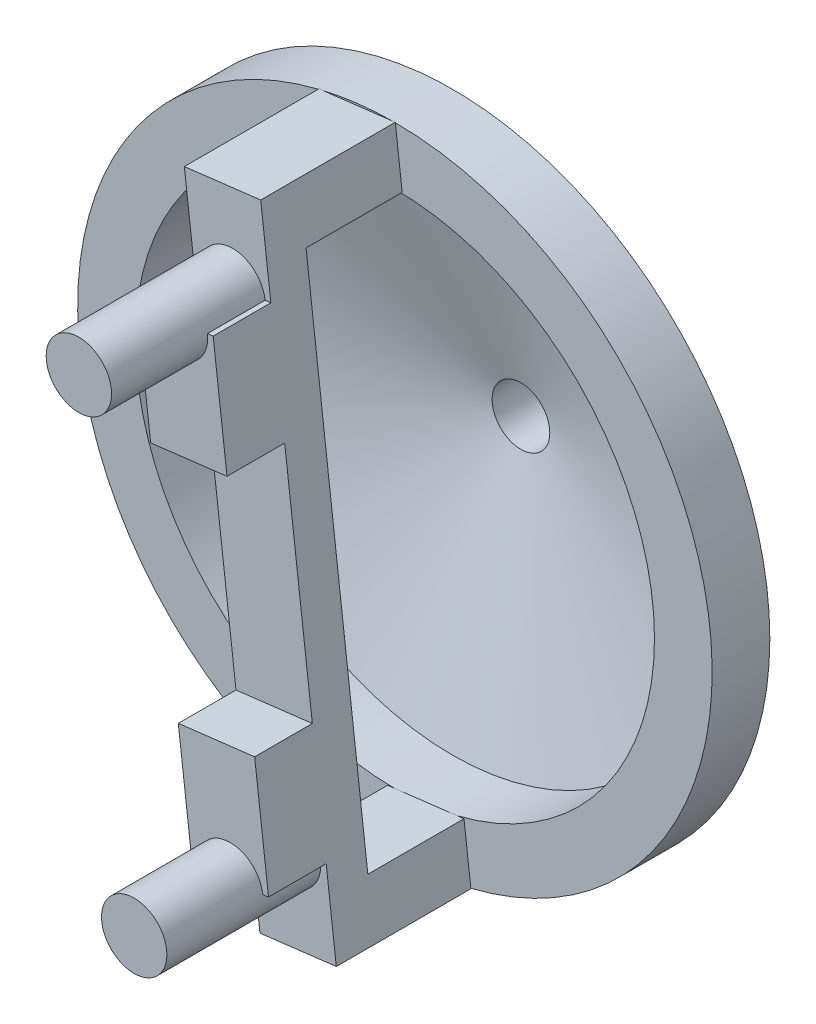
ISO-10303-21;
HEADER;
FILE_DESCRIPTION(('STEP AP214'),'2;1');
FILE_NAME('part.step','',(''),(''),'','','');
FILE_SCHEMA(('AUTOMOTIVE_DESIGN { 1 0 10303 214 1 1 1 1 }'));
ENDSEC;
DATA;
#1=APPLICATION_CONTEXT('core data for automotive mechanical design processes');
#2=APPLICATION_PROTOCOL_DEFINITION('international standard','automotive_design',2000,#1);
#3=PRODUCT_CONTEXT('',#1,'mechanical');
#4=PRODUCT('Part','Part','',(#3));
#5=PRODUCT_RELATED_PRODUCT_CATEGORY('part','',(#4));
#6=PRODUCT_DEFINITION_FORMATION('','',#4);
#7=PRODUCT_DEFINITION_CONTEXT('part definition',#1,'design');
#8=PRODUCT_DEFINITION('design','',#6,#7);
#9=PRODUCT_DEFINITION_SHAPE('','',#8);
#10=(LENGTH_UNIT() NAMED_UNIT(*) SI_UNIT(.MILLI.,.METRE.));
#11=(NAMED_UNIT(*) PLANE_ANGLE_UNIT() SI_UNIT($,.RADIAN.));
#12=(NAMED_UNIT(*) SI_UNIT($,.STERADIAN.) SOLID_ANGLE_UNIT());
#13=UNCERTAINTY_MEASURE_WITH_UNIT(LENGTH_MEASURE(1.E-05),#10,'distance_accuracy_value','');
#14=(GEOMETRIC_REPRESENTATION_CONTEXT(3) GLOBAL_UNCERTAINTY_ASSIGNED_CONTEXT((#13)) GLOBAL_UNIT_ASSIGNED_CONTEXT((#10,
#11,#12)) REPRESENTATION_CONTEXT('',''));
#15=CARTESIAN_POINT('',(0.,0.,0.));
#16=DIRECTION('',(0.,0.,1.));
#17=DIRECTION('',(1.,0.,0.));
#18=AXIS2_PLACEMENT_3D('',#15,#16,#17);
#19=CARTESIAN_POINT('',(0.0107708516474273,8.24999296901245,18.));
#20=DIRECTION('',(0.,0.,-1.));
#21=DIRECTION('',(-1.,0.,0.));
#22=AXIS2_PLACEMENT_3D('',#19,#20,#21);
#23=PLANE('',#22);
#24=DIRECTION('',(-0.992784030995101,-0.119916086498513,0.));
#25=VECTOR('',#24,1.);
#26=CARTESIAN_POINT('',(1.35253229049064,-2.85843600648679,18.));
#27=LINE('',#26,#25);
#28=CARTESIAN_POINT('',(1.35253229049064,-2.85843600648679,18.));
#29=VERTEX_POINT('',#28);
#30=CARTESIAN_POINT('',(-0.633035771499563,-3.09826817948382,18.));
#31=VERTEX_POINT('',#30);
#32=EDGE_CURVE('E218',#29,#31,#27,.T.);
#33=ORIENTED_EDGE('',*,*,#32,.F.);
#34=DIRECTION('',(-0.119916086498513,0.992784030995101,0.));
#35=VECTOR('',#34,1.);
#36=CARTESIAN_POINT('',(0.0107708516474273,8.24999296901245,18.));
#37=LINE('',#36,#35);
#38=CARTESIAN_POINT('',(0.633035771499563,3.09826817948381,18.));
#39=VERTEX_POINT('',#38);
#40=EDGE_CURVE('E204',#29,#39,#37,.T.);
#41=ORIENTED_EDGE('',*,*,#40,.T.);
#42=DIRECTION('',(0.992784030995101,0.119916086498513,0.));
#43=VECTOR('',#42,1.);
#44=CARTESIAN_POINT('',(-1.35253229049064,2.85843600648679,18.));
#45=LINE('',#44,#43);
#46=CARTESIAN_POINT('',(-1.35253229049064,2.85843600648679,18.));
#47=VERTEX_POINT('',#46);
#48=EDGE_CURVE('E472',#47,#39,#45,.T.);
#49=ORIENTED_EDGE('',*,*,#48,.F.);
#50=DIRECTION('',(0.119916086498513,-0.992784030995101,0.));
#51=VECTOR('',#50,1.);
#52=CARTESIAN_POINT('',(-1.97479721034277,8.01016079601542,18.));
#53=LINE('',#52,#51);
#54=EDGE_CURVE('E448',#47,#31,#53,.T.);
#55=ORIENTED_EDGE('',*,*,#54,.T.);
#56=EDGE_LOOP('',(#33,#41,#49,#55));
#57=FACE_BOUND('',#56,.T.);
#58=ADVANCED_FACE('F200',(#57),#23,.F.);
#59=DIRECTION('',(0.992784030995101,0.119916086498513,0.));
#60=VECTOR('',#59,1.);
#61=CARTESIAN_POINT('',(1.71228054998618,-5.83678809947209,18.));
#62=LINE('',#61,#60);
#63=CARTESIAN_POINT('',(-0.273287512004025,-6.07662027246912,18.));
#64=VERTEX_POINT('',#63);
#65=CARTESIAN_POINT('',(1.71228054998618,-5.83678809947209,18.));
#66=VERTEX_POINT('',#65);
#67=EDGE_CURVE('E226',#64,#66,#62,.T.);
#68=ORIENTED_EDGE('',*,*,#67,.F.);
#69=CARTESIAN_POINT('',(-0.00947212170729466,-8.26074514065834,18.));
#70=VERTEX_POINT('',#69);
#71=EDGE_CURVE('E458',#64,#70,#53,.T.);
#72=ORIENTED_EDGE('',*,*,#71,.T.);
#73=DIRECTION('',(0.992784030995101,0.119916086498514,0.));
#74=VECTOR('',#73,1.);
#75=CARTESIAN_POINT('',(-0.00947212170729466,-8.26074514065834,18.));
#76=LINE('',#75,#74);
#77=CARTESIAN_POINT('',(1.97609594028291,-8.02091296766131,18.));
#78=VERTEX_POINT('',#77);
#79=EDGE_CURVE('E564',#70,#78,#76,.T.);
#80=ORIENTED_EDGE('',*,*,#79,.T.);
#81=EDGE_CURVE('E518',#78,#66,#37,.T.);
#82=ORIENTED_EDGE('',*,*,#81,.T.);
#83=EDGE_LOOP('',(#68,#72,#80,#82));
#84=FACE_BOUND('',#83,.T.);
#85=ADVANCED_FACE('F547',(#84),#23,.F.);
#86=CARTESIAN_POINT('',(-0.719496518991075,5.95670418597061,22.));
#87=DIRECTION('',(0.,0.,-1.));
#88=DIRECTION('',(-1.,0.,0.));
#89=AXIS2_PLACEMENT_3D('',#86,#87,#88);
#90=CYLINDRICAL_SURFACE('',#89,0.85);
#91=CARTESIAN_POINT('',(-0.719496518991075,5.95670418597061,22.));
#92=DIRECTION('',(0.,0.,1.));
#93=DIRECTION('',(1.,0.,0.));
#94=AXIS2_PLACEMENT_3D('',#91,#92,#93);
#95=CIRCLE('',#94,0.85);
#96=CARTESIAN_POINT('',(0.130503481008925,5.95670418597061,22.));
#97=VERTEX_POINT('',#96);
#98=EDGE_CURVE('E210',#97,#97,#95,.T.);
#99=ORIENTED_EDGE('',*,*,#98,.F.);
#100=EDGE_LOOP('',(#99));
#101=FACE_BOUND('',#100,.T.);
#102=DIRECTION('',(0.,0.,-1.));
#103=VECTOR('',#102,1.);
#104=CARTESIAN_POINT('',(-1.56336294533691,5.85477551244687,22.));
#105=LINE('',#104,#103);
#106=CARTESIAN_POINT('',(-1.56336294533691,5.85477551244687,19.5));
#107=VERTEX_POINT('',#106);
#108=CARTESIAN_POINT('',(-1.56336294533691,5.85477551244687,18.));
#109=VERTEX_POINT('',#108);
#110=EDGE_CURVE('E534',#107,#109,#105,.T.);
#111=ORIENTED_EDGE('',*,*,#110,.F.);
#112=CARTESIAN_POINT('',(-0.719496518991075,5.95670418597061,19.5));
#113=DIRECTION('',(0.,0.,1.));
#114=DIRECTION('',(1.,0.,0.));
#115=AXIS2_PLACEMENT_3D('',#112,#113,#114);
#116=CIRCLE('',#115,0.85);
#117=CARTESIAN_POINT('',(0.12436990735476,6.05863285949434,19.5));
#118=VERTEX_POINT('',#117);
#119=EDGE_CURVE('E14',#107,#118,#116,.T.);
#120=ORIENTED_EDGE('',*,*,#119,.T.);
#121=DIRECTION('',(0.,0.,-1.));
#122=VECTOR('',#121,1.);
#123=CARTESIAN_POINT('',(0.12436990735476,6.05863285949434,22.));
#124=LINE('',#123,#122);
#125=CARTESIAN_POINT('',(0.12436990735476,6.05863285949434,18.));
#126=VERTEX_POINT('',#125);
#127=EDGE_CURVE('E466',#126,#118,#124,.F.);
#128=ORIENTED_EDGE('',*,*,#127,.F.);
#129=CARTESIAN_POINT('',(-0.719496518991075,5.95670418597061,18.));
#130=DIRECTION('',(0.,0.,1.));
#131=DIRECTION('',(1.,0.,0.));
#132=AXIS2_PLACEMENT_3D('',#129,#130,#131);
#133=CIRCLE('',#132,0.85);
#134=EDGE_CURVE('E536',#126,#109,#133,.T.);
#135=ORIENTED_EDGE('',*,*,#134,.T.);
#136=EDGE_LOOP('',(#111,#120,#128,#135));
#137=FACE_BOUND('',#136,.T.);
#138=ADVANCED_FACE('F202',(#101,#137),#90,.T.);
#139=CARTESIAN_POINT('',(-0.719496518991075,5.95670418597061,22.));
#140=DIRECTION('',(0.,0.,1.));
#141=DIRECTION('',(1.,0.,0.));
#142=AXIS2_PLACEMENT_3D('',#139,#140,#141);
#143=PLANE('',#142);
#144=ORIENTED_EDGE('',*,*,#98,.T.);
#145=EDGE_LOOP('',(#144));
#146=FACE_BOUND('',#145,.T.);
#147=ADVANCED_FACE('F544',(#146),#143,.T.);
#148=CARTESIAN_POINT('',(-1.35253229049064,2.85843600648679,19.5));
#149=DIRECTION('',(0.,0.,1.));
#150=DIRECTION('',(1.,0.,0.));
#151=AXIS2_PLACEMENT_3D('',#148,#149,#150);
#152=PLANE('',#151);
#153=ORIENTED_EDGE('',*,*,#119,.F.);
#154=DIRECTION('',(-0.992784030995101,-0.119916086498513,0.));
#155=VECTOR('',#154,1.);
#156=CARTESIAN_POINT('',(-1.71228054998618,5.83678809947209,19.5));
#157=LINE('',#156,#155);
#158=CARTESIAN_POINT('',(-1.71228054998618,5.83678809947209,19.5));
#159=VERTEX_POINT('',#158);
#160=EDGE_CURVE('E507',#107,#159,#157,.T.);
#161=ORIENTED_EDGE('',*,*,#160,.T.);
#162=DIRECTION('',(0.119916086498513,-0.992784030995101,0.));
#163=VECTOR('',#162,1.);
#164=CARTESIAN_POINT('',(-1.71228054998618,5.83678809947209,19.5));
#165=LINE('',#164,#163);
#166=CARTESIAN_POINT('',(-1.35253229049064,2.85843600648679,19.5));
#167=VERTEX_POINT('',#166);
#168=EDGE_CURVE('E495',#159,#167,#165,.T.);
#169=ORIENTED_EDGE('',*,*,#168,.T.);
#170=DIRECTION('',(0.992784030995101,0.119916086498513,0.));
#171=VECTOR('',#170,1.);
#172=CARTESIAN_POINT('',(-1.35253229049064,2.85843600648679,19.5));
#173=LINE('',#172,#171);
#174=CARTESIAN_POINT('',(0.633035771499564,3.09826817948382,19.5));
#175=VERTEX_POINT('',#174);
#176=EDGE_CURVE('E513',#167,#175,#173,.T.);
#177=ORIENTED_EDGE('',*,*,#176,.T.);
#178=DIRECTION('',(-0.119916086498513,0.992784030995101,0.));
#179=VECTOR('',#178,1.);
#180=CARTESIAN_POINT('',(0.273287512004025,6.07662027246912,19.5));
#181=LINE('',#180,#179);
#182=CARTESIAN_POINT('',(0.273287512004025,6.07662027246912,19.5));
#183=VERTEX_POINT('',#182);
#184=EDGE_CURVE('E510',#175,#183,#181,.T.);
#185=ORIENTED_EDGE('',*,*,#184,.T.);
#186=EDGE_CURVE('E483',#183,#118,#157,.T.);
#187=ORIENTED_EDGE('',*,*,#186,.T.);
#188=EDGE_LOOP('',(#153,#161,#169,#177,#185,#187));
#189=FACE_BOUND('',#188,.T.);
#190=ADVANCED_FACE('F548',(#189),#152,.T.);
#191=CARTESIAN_POINT('',(-1.71228054998618,5.83678809947209,19.5));
#192=DIRECTION('',(0.119916086498513,-0.992784030995101,0.));
#193=DIRECTION('',(0.992784030995101,0.119916086498513,0.));
#194=AXIS2_PLACEMENT_3D('',#191,#192,#193);
#195=PLANE('',#194);
#196=ORIENTED_EDGE('',*,*,#160,.F.);
#197=ORIENTED_EDGE('',*,*,#110,.T.);
#198=DIRECTION('',(-0.992784030995101,-0.119916086498513,0.));
#199=VECTOR('',#198,1.);
#200=CARTESIAN_POINT('',(-1.71228054998618,5.83678809947209,18.));
#201=LINE('',#200,#199);
#202=CARTESIAN_POINT('',(-1.71228054998618,5.83678809947209,18.));
#203=VERTEX_POINT('',#202);
#204=EDGE_CURVE('E476',#109,#203,#201,.T.);
#205=ORIENTED_EDGE('',*,*,#204,.T.);
#206=DIRECTION('',(0.,0.,-1.));
#207=VECTOR('',#206,1.);
#208=CARTESIAN_POINT('',(-1.71228054998618,5.83678809947209,19.5));
#209=LINE('',#208,#207);
#210=EDGE_CURVE('E498',#159,#203,#209,.T.);
#211=ORIENTED_EDGE('',*,*,#210,.F.);
#212=EDGE_LOOP('',(#196,#197,#205,#211));
#213=FACE_BOUND('',#212,.T.);
#214=ADVANCED_FACE('F549',(#213),#195,.F.);
#215=CARTESIAN_POINT('',(0.273287512004025,6.07662027246912,18.));
#216=VERTEX_POINT('',#215);
#217=EDGE_CURVE('E492',#216,#126,#201,.T.);
#218=ORIENTED_EDGE('',*,*,#217,.T.);
#219=ORIENTED_EDGE('',*,*,#127,.T.);
#220=ORIENTED_EDGE('',*,*,#186,.F.);
#221=DIRECTION('',(0.,0.,-1.));
#222=VECTOR('',#221,1.);
#223=CARTESIAN_POINT('',(0.273287512004025,6.07662027246912,19.5));
#224=LINE('',#223,#222);
#225=EDGE_CURVE('E471',#183,#216,#224,.T.);
#226=ORIENTED_EDGE('',*,*,#225,.T.);
#227=EDGE_LOOP('',(#218,#219,#220,#226));
#228=FACE_BOUND('',#227,.T.);
#229=ADVANCED_FACE('F530',(#228),#195,.F.);
#230=CARTESIAN_POINT('',(-1.71228054998618,5.83678809947209,19.5));
#231=DIRECTION('',(0.992784030995101,0.119916086498513,0.));
#232=DIRECTION('',(-0.119916086498513,0.992784030995101,0.));
#233=AXIS2_PLACEMENT_3D('',#230,#231,#232);
#234=PLANE('',#233);
#235=ORIENTED_EDGE('',*,*,#210,.T.);
#236=CARTESIAN_POINT('',(-1.97609594028291,8.02091296766131,18.));
#237=VERTEX_POINT('',#236);
#238=EDGE_CURVE('E444',#237,#203,#53,.T.);
#239=ORIENTED_EDGE('',*,*,#238,.F.);
#240=DIRECTION('',(0.,0.,-1.));
#241=VECTOR('',#240,1.);
#242=CARTESIAN_POINT('',(-1.97609594028291,8.02091296766131,18.));
#243=LINE('',#242,#241);
#244=CARTESIAN_POINT('',(-1.97609594028291,8.02091296766131,14.5));
#245=VERTEX_POINT('',#244);
#246=EDGE_CURVE('E676',#237,#245,#243,.T.);
#247=ORIENTED_EDGE('',*,*,#246,.T.);
#248=DIRECTION('',(0.119916086498514,-0.992784030995101,0.));
#249=VECTOR('',#248,1.);
#250=CARTESIAN_POINT('',(-1.79622181053513,6.53173692116866,14.5));
#251=LINE('',#250,#249);
#252=CARTESIAN_POINT('',(-1.97479721034278,8.01016079601542,14.5));
#253=VERTEX_POINT('',#252);
#254=EDGE_CURVE('E650',#245,#253,#251,.T.);
#255=ORIENTED_EDGE('',*,*,#254,.T.);
#256=CARTESIAN_POINT('',(-1.79622181053513,6.53173692116866,14.5));
#257=VERTEX_POINT('',#256);
#258=EDGE_CURVE('E652',#253,#257,#251,.T.);
#259=ORIENTED_EDGE('',*,*,#258,.T.);
#260=DIRECTION('',(0.,0.,-1.));
#261=VECTOR('',#260,1.);
#262=CARTESIAN_POINT('',(-1.79622181053513,6.53173692116866,18.));
#263=LINE('',#262,#261);
#264=CARTESIAN_POINT('',(-1.79622181053513,6.53173692116866,17.));
#265=VERTEX_POINT('',#264);
#266=EDGE_CURVE('E660',#265,#257,#263,.T.);
#267=ORIENTED_EDGE('',*,*,#266,.F.);
#268=DIRECTION('',(0.119916086498513,-0.992784030995101,0.));
#269=VECTOR('',#268,1.);
#270=CARTESIAN_POINT('',(-1.97479721034277,8.01016079601542,17.));
#271=LINE('',#270,#269);
#272=CARTESIAN_POINT('',(-0.189346251455067,-6.77156909416569,17.));
#273=VERTEX_POINT('',#272);
#274=EDGE_CURVE('E598',#265,#273,#271,.T.);
#275=ORIENTED_EDGE('',*,*,#274,.T.);
#276=DIRECTION('',(0.,0.,-1.));
#277=VECTOR('',#276,1.);
#278=CARTESIAN_POINT('',(-0.189346251455066,-6.77156909416569,18.));
#279=LINE('',#278,#277);
#280=CARTESIAN_POINT('',(-0.189346251455066,-6.77156909416569,14.5));
#281=VERTEX_POINT('',#280);
#282=EDGE_CURVE('E571',#273,#281,#279,.T.);
#283=ORIENTED_EDGE('',*,*,#282,.T.);
#284=DIRECTION('',(0.119916086498514,-0.992784030995101,0.));
#285=VECTOR('',#284,1.);
#286=CARTESIAN_POINT('',(-0.189346251455066,-6.77156909416569,14.5));
#287=LINE('',#286,#285);
#288=CARTESIAN_POINT('',(-0.0107708516474245,-8.24999296901245,14.5));
#289=VERTEX_POINT('',#288);
#290=EDGE_CURVE('E584',#281,#289,#287,.T.);
#291=ORIENTED_EDGE('',*,*,#290,.T.);
#292=CARTESIAN_POINT('',(-0.00947212170729466,-8.26074514065834,14.5));
#293=VERTEX_POINT('',#292);
#294=EDGE_CURVE('E588',#289,#293,#287,.T.);
#295=ORIENTED_EDGE('',*,*,#294,.T.);
#296=DIRECTION('',(0.,0.,-1.));
#297=VECTOR('',#296,1.);
#298=CARTESIAN_POINT('',(-0.00947212170729466,-8.26074514065834,18.));
#299=LINE('',#298,#297);
#300=EDGE_CURVE('E452',#70,#293,#299,.T.);
#301=ORIENTED_EDGE('',*,*,#300,.F.);
#302=ORIENTED_EDGE('',*,*,#71,.F.);
#303=DIRECTION('',(0.,0.,-1.));
#304=VECTOR('',#303,1.);
#305=CARTESIAN_POINT('',(-0.273287512004025,-6.07662027246912,19.5));
#306=LINE('',#305,#304);
#307=CARTESIAN_POINT('',(-0.273287512004025,-6.07662027246912,19.5));
#308=VERTEX_POINT('',#307);
#309=EDGE_CURVE('E390',#308,#64,#306,.T.);
#310=ORIENTED_EDGE('',*,*,#309,.F.);
#311=DIRECTION('',(0.119916086498513,-0.992784030995101,0.));
#312=VECTOR('',#311,1.);
#313=CARTESIAN_POINT('',(-0.273287512004025,-6.07662027246912,19.5));
#314=LINE('',#313,#312);
#315=CARTESIAN_POINT('',(-0.633035771499564,-3.09826817948382,19.5));
#316=VERTEX_POINT('',#315);
#317=EDGE_CURVE('E372',#316,#308,#314,.T.);
#318=ORIENTED_EDGE('',*,*,#317,.F.);
#319=DIRECTION('',(0.,0.,-1.));
#320=VECTOR('',#319,1.);
#321=CARTESIAN_POINT('',(-0.633035771499564,-3.09826817948382,19.5));
#322=LINE('',#321,#320);
#323=EDGE_CURVE('E369',#316,#31,#322,.T.);
#324=ORIENTED_EDGE('',*,*,#323,.T.);
#325=ORIENTED_EDGE('',*,*,#54,.F.);
#326=DIRECTION('',(0.,0.,-1.));
#327=VECTOR('',#326,1.);
#328=CARTESIAN_POINT('',(-1.35253229049064,2.85843600648679,19.5));
#329=LINE('',#328,#327);
#330=EDGE_CURVE('E463',#167,#47,#329,.T.);
#331=ORIENTED_EDGE('',*,*,#330,.F.);
#332=ORIENTED_EDGE('',*,*,#168,.F.);
#333=EDGE_LOOP('',(#235,#239,#247,#255,#259,#267,#275,#283,#291,#295,#301,#302,#310,#318,#324,
#325,#331,#332));
#334=FACE_BOUND('',#333,.T.);
#335=ADVANCED_FACE('F550',(#334),#234,.F.);
#336=CARTESIAN_POINT('',(-1.35253229049064,2.85843600648679,19.5));
#337=DIRECTION('',(-0.119916086498513,0.992784030995101,0.));
#338=DIRECTION('',(-0.992784030995101,-0.119916086498513,0.));
#339=AXIS2_PLACEMENT_3D('',#336,#337,#338);
#340=PLANE('',#339);
#341=ORIENTED_EDGE('',*,*,#48,.T.);
#342=DIRECTION('',(0.,0.,-1.));
#343=VECTOR('',#342,1.);
#344=CARTESIAN_POINT('',(0.633035771499564,3.09826817948382,19.5));
#345=LINE('',#344,#343);
#346=EDGE_CURVE('E467',#175,#39,#345,.T.);
#347=ORIENTED_EDGE('',*,*,#346,.F.);
#348=ORIENTED_EDGE('',*,*,#176,.F.);
#349=ORIENTED_EDGE('',*,*,#330,.T.);
#350=EDGE_LOOP('',(#341,#347,#348,#349));
#351=FACE_BOUND('',#350,.T.);
#352=ADVANCED_FACE('F525',(#351),#340,.F.);
#353=CARTESIAN_POINT('',(0.273287512004025,6.07662027246912,19.5));
#354=DIRECTION('',(-0.992784030995101,-0.119916086498513,0.));
#355=DIRECTION('',(0.119916086498513,-0.992784030995101,0.));
#356=AXIS2_PLACEMENT_3D('',#353,#354,#355);
#357=PLANE('',#356);
#358=ORIENTED_EDGE('',*,*,#346,.T.);
#359=ORIENTED_EDGE('',*,*,#40,.F.);
#360=DIRECTION('',(0.,0.,-1.));
#361=VECTOR('',#360,1.);
#362=CARTESIAN_POINT('',(1.35253229049064,-2.85843600648679,19.5));
#363=LINE('',#362,#361);
#364=CARTESIAN_POINT('',(1.35253229049064,-2.85843600648679,19.5));
#365=VERTEX_POINT('',#364);
#366=EDGE_CURVE('E367',#365,#29,#363,.T.);
#367=ORIENTED_EDGE('',*,*,#366,.F.);
#368=DIRECTION('',(-0.119916086498513,0.992784030995101,0.));
#369=VECTOR('',#368,1.);
#370=CARTESIAN_POINT('',(1.71228054998618,-5.83678809947209,19.5));
#371=LINE('',#370,#369);
#372=CARTESIAN_POINT('',(1.71228054998618,-5.83678809947209,19.5));
#373=VERTEX_POINT('',#372);
#374=EDGE_CURVE('E373',#373,#365,#371,.T.);
#375=ORIENTED_EDGE('',*,*,#374,.F.);
#376=DIRECTION('',(0.,0.,-1.));
#377=VECTOR('',#376,1.);
#378=CARTESIAN_POINT('',(1.71228054998618,-5.83678809947209,19.5));
#379=LINE('',#378,#377);
#380=EDGE_CURVE('E556',#373,#66,#379,.T.);
#381=ORIENTED_EDGE('',*,*,#380,.T.);
#382=ORIENTED_EDGE('',*,*,#81,.F.);
#383=DIRECTION('',(0.,0.,-1.));
#384=VECTOR('',#383,1.);
#385=CARTESIAN_POINT('',(1.97609594028291,-8.02091296766131,18.));
#386=LINE('',#385,#384);
#387=CARTESIAN_POINT('',(1.97609594028291,-8.02091296766131,14.5));
#388=VERTEX_POINT('',#387);
#389=EDGE_CURVE('E570',#78,#388,#386,.T.);
#390=ORIENTED_EDGE('',*,*,#389,.T.);
#391=DIRECTION('',(-0.119916086498514,0.992784030995101,0.));
#392=VECTOR('',#391,1.);
#393=CARTESIAN_POINT('',(1.79622181053513,-6.53173692116866,14.5));
#394=LINE('',#393,#392);
#395=CARTESIAN_POINT('',(1.97479721034278,-8.01016079601542,14.5));
#396=VERTEX_POINT('',#395);
#397=EDGE_CURVE('E593',#388,#396,#394,.T.);
#398=ORIENTED_EDGE('',*,*,#397,.T.);
#399=CARTESIAN_POINT('',(1.79622181053513,-6.53173692116866,14.5));
#400=VERTEX_POINT('',#399);
#401=EDGE_CURVE('E591',#396,#400,#394,.T.);
#402=ORIENTED_EDGE('',*,*,#401,.T.);
#403=DIRECTION('',(0.,0.,-1.));
#404=VECTOR('',#403,1.);
#405=CARTESIAN_POINT('',(1.79622181053513,-6.53173692116866,18.));
#406=LINE('',#405,#404);
#407=CARTESIAN_POINT('',(1.79622181053513,-6.53173692116866,17.));
#408=VERTEX_POINT('',#407);
#409=EDGE_CURVE('E575',#408,#400,#406,.T.);
#410=ORIENTED_EDGE('',*,*,#409,.F.);
#411=DIRECTION('',(-0.119916086498513,0.992784030995101,0.));
#412=VECTOR('',#411,1.);
#413=CARTESIAN_POINT('',(0.0107708516474273,8.24999296901245,17.));
#414=LINE('',#413,#412);
#415=CARTESIAN_POINT('',(0.189346251455066,6.77156909416569,17.));
#416=VERTEX_POINT('',#415);
#417=EDGE_CURVE('E460',#408,#416,#414,.T.);
#418=ORIENTED_EDGE('',*,*,#417,.T.);
#419=DIRECTION('',(0.,0.,-1.));
#420=VECTOR('',#419,1.);
#421=CARTESIAN_POINT('',(0.189346251455066,6.77156909416569,18.));
#422=LINE('',#421,#420);
#423=CARTESIAN_POINT('',(0.189346251455066,6.77156909416569,14.5));
#424=VERTEX_POINT('',#423);
#425=EDGE_CURVE('E607',#416,#424,#422,.T.);
#426=ORIENTED_EDGE('',*,*,#425,.T.);
#427=DIRECTION('',(-0.119916086498514,0.992784030995101,0.));
#428=VECTOR('',#427,1.);
#429=CARTESIAN_POINT('',(0.189346251455066,6.77156909416569,14.5));
#430=LINE('',#429,#428);
#431=CARTESIAN_POINT('',(0.0107708516474245,8.24999296901245,14.5));
#432=VERTEX_POINT('',#431);
#433=EDGE_CURVE('E649',#424,#432,#430,.T.);
#434=ORIENTED_EDGE('',*,*,#433,.T.);
#435=CARTESIAN_POINT('',(0.00947212170729466,8.26074514065834,14.5));
#436=VERTEX_POINT('',#435);
#437=EDGE_CURVE('E664',#432,#436,#430,.T.);
#438=ORIENTED_EDGE('',*,*,#437,.T.);
#439=DIRECTION('',(0.,0.,-1.));
#440=VECTOR('',#439,1.);
#441=CARTESIAN_POINT('',(0.00947212170729466,8.26074514065834,18.));
#442=LINE('',#441,#440);
#443=CARTESIAN_POINT('',(0.00947212170729466,8.26074514065834,18.));
#444=VERTEX_POINT('',#443);
#445=EDGE_CURVE('E681',#444,#436,#442,.T.);
#446=ORIENTED_EDGE('',*,*,#445,.F.);
#447=EDGE_CURVE('E447',#216,#444,#37,.T.);
#448=ORIENTED_EDGE('',*,*,#447,.F.);
#449=ORIENTED_EDGE('',*,*,#225,.F.);
#450=ORIENTED_EDGE('',*,*,#184,.F.);
#451=EDGE_LOOP('',(#358,#359,#367,#375,#381,#382,#390,#398,#402,#410,#418,#426,#434,#438,#446,
#448,#449,#450));
#452=FACE_BOUND('',#451,.T.);
#453=ADVANCED_FACE('F384',(#452),#357,.F.);
#454=CARTESIAN_POINT('',(0.0107708516474273,8.24999296901245,17.));
#455=DIRECTION('',(0.,0.,-1.));
#456=DIRECTION('',(-1.,0.,0.));
#457=AXIS2_PLACEMENT_3D('',#454,#455,#456);
#458=PLANE('',#457);
#459=ORIENTED_EDGE('',*,*,#274,.F.);
#460=DIRECTION('',(0.992784030995101,0.119916086498515,0.));
#461=VECTOR('',#460,1.);
#462=CARTESIAN_POINT('',(0.18934625145507,6.77156909416569,17.));
#463=LINE('',#462,#461);
#464=EDGE_CURVE('E612',#265,#416,#463,.T.);
#465=ORIENTED_EDGE('',*,*,#464,.T.);
#466=ORIENTED_EDGE('',*,*,#417,.F.);
#467=DIRECTION('',(-0.992784030995101,-0.119916086498515,0.));
#468=VECTOR('',#467,1.);
#469=CARTESIAN_POINT('',(1.79622181053518,-6.53173692116865,17.));
#470=LINE('',#469,#468);
#471=EDGE_CURVE('E519',#408,#273,#470,.T.);
#472=ORIENTED_EDGE('',*,*,#471,.T.);
#473=EDGE_LOOP('',(#459,#465,#466,#472));
#474=FACE_BOUND('',#473,.T.);
#475=ADVANCED_FACE('F611',(#474),#458,.T.);
#476=CARTESIAN_POINT('',(0.,0.,14.5));
#477=DIRECTION('',(0.,0.,1.));
#478=DIRECTION('',(1.,0.,0.));
#479=AXIS2_PLACEMENT_3D('',#476,#477,#478);
#480=PLANE('',#479);
#481=CARTESIAN_POINT('',(0.,0.,14.5));
#482=DIRECTION('',(0.,0.,1.));
#483=DIRECTION('',(1.,0.,0.));
#484=AXIS2_PLACEMENT_3D('',#481,#482,#483);
#485=CIRCLE('',#484,8.25);
#486=CARTESIAN_POINT('',(-0.082938343075674,8.24958309439016,14.5));
#487=VERTEX_POINT('',#486);
#488=CARTESIAN_POINT('',(-1.88368547549996,8.0320750139295,14.5));
#489=VERTEX_POINT('',#488);
#490=EDGE_CURVE('E628',#487,#489,#485,.T.);
#491=ORIENTED_EDGE('',*,*,#490,.T.);
#492=DIRECTION('',(-0.992784030995101,-0.119916086498514,0.));
#493=VECTOR('',#492,1.);
#494=CARTESIAN_POINT('',(0.00947212170729466,8.26074514065834,14.5));
#495=LINE('',#494,#493);
#496=EDGE_CURVE('E667',#487,#489,#495,.T.);
#497=ORIENTED_EDGE('',*,*,#496,.F.);
#498=EDGE_LOOP('',(#491,#497));
#499=FACE_BOUND('',#498,.T.);
#500=ADVANCED_FACE('F723',(#499),#480,.T.);
#501=EDGE_CURVE('E1022',#396,#432,#485,.T.);
#502=ORIENTED_EDGE('',*,*,#501,.T.);
#503=ORIENTED_EDGE('',*,*,#433,.F.);
#504=DIRECTION('',(0.9927840309951,0.119916086498515,0.));
#505=VECTOR('',#504,1.);
#506=CARTESIAN_POINT('',(0.189346251455066,6.77156909416569,14.5));
#507=LINE('',#506,#505);
#508=CARTESIAN_POINT('',(0.010705659237017,6.74999151028061,14.5));
#509=VERTEX_POINT('',#508);
#510=EDGE_CURVE('E640',#509,#424,#507,.T.);
#511=ORIENTED_EDGE('',*,*,#510,.F.);
#512=CARTESIAN_POINT('',(0.,0.,14.5));
#513=DIRECTION('',(0.,0.,1.));
#514=DIRECTION('',(1.,0.,0.));
#515=AXIS2_PLACEMENT_3D('',#512,#513,#514);
#516=CIRCLE('',#515,6.75);
#517=CARTESIAN_POINT('',(1.61758121831712,-6.55331450505374,14.5));
#518=VERTEX_POINT('',#517);
#519=EDGE_CURVE('E624',#518,#509,#516,.T.);
#520=ORIENTED_EDGE('',*,*,#519,.F.);
#521=DIRECTION('',(-0.9927840309951,-0.119916086498515,0.));
#522=VECTOR('',#521,1.);
#523=CARTESIAN_POINT('',(-0.189346251455066,-6.77156909416569,14.5));
#524=LINE('',#523,#522);
#525=EDGE_CURVE('E572',#400,#518,#524,.T.);
#526=ORIENTED_EDGE('',*,*,#525,.F.);
#527=ORIENTED_EDGE('',*,*,#401,.F.);
#528=EDGE_LOOP('',(#502,#503,#511,#520,#526,#527));
#529=FACE_BOUND('',#528,.T.);
#530=ADVANCED_FACE('F647',(#529),#480,.T.);
#531=CARTESIAN_POINT('',(-1.61758121831712,6.55331450505374,14.5));
#532=VERTEX_POINT('',#531);
#533=EDGE_CURVE('E643',#257,#532,#507,.T.);
#534=ORIENTED_EDGE('',*,*,#533,.F.);
#535=ORIENTED_EDGE('',*,*,#258,.F.);
#536=EDGE_CURVE('E623',#253,#289,#485,.T.);
#537=ORIENTED_EDGE('',*,*,#536,.T.);
#538=ORIENTED_EDGE('',*,*,#290,.F.);
#539=CARTESIAN_POINT('',(-0.010705659237017,-6.74999151028061,14.5));
#540=VERTEX_POINT('',#539);
#541=EDGE_CURVE('E579',#540,#281,#524,.T.);
#542=ORIENTED_EDGE('',*,*,#541,.F.);
#543=EDGE_CURVE('E614',#532,#540,#516,.T.);
#544=ORIENTED_EDGE('',*,*,#543,.F.);
#545=EDGE_LOOP('',(#534,#535,#537,#538,#542,#544));
#546=FACE_BOUND('',#545,.T.);
#547=ADVANCED_FACE('F690',(#546),#480,.T.);
#548=CARTESIAN_POINT('',(-0.00947212170729472,-8.26074514065834,14.5));
#549=DIRECTION('',(0.,0.,1.));
#550=DIRECTION('',(1.,0.,0.));
#551=AXIS2_PLACEMENT_3D('',#548,#549,#550);
#552=PLANE('',#551);
#553=ORIENTED_EDGE('',*,*,#294,.F.);
#554=CARTESIAN_POINT('',(0.082938343075674,-8.24958309439016,14.5));
#555=VERTEX_POINT('',#554);
#556=EDGE_CURVE('E582',#289,#555,#485,.T.);
#557=ORIENTED_EDGE('',*,*,#556,.T.);
#558=DIRECTION('',(0.992784030995101,0.119916086498514,0.));
#559=VECTOR('',#558,1.);
#560=CARTESIAN_POINT('',(-0.00947212170729466,-8.26074514065834,14.5));
#561=LINE('',#560,#559);
#562=EDGE_CURVE('E589',#293,#555,#561,.T.);
#563=ORIENTED_EDGE('',*,*,#562,.F.);
#564=EDGE_LOOP('',(#553,#557,#563));
#565=FACE_BOUND('',#564,.T.);
#566=ADVANCED_FACE('F701',(#565),#552,.F.);
#567=EDGE_CURVE('E618',#540,#518,#516,.T.);
#568=ORIENTED_EDGE('',*,*,#567,.F.);
#569=EDGE_CURVE('E577',#518,#540,#524,.T.);
#570=ORIENTED_EDGE('',*,*,#569,.F.);
#571=EDGE_LOOP('',(#568,#570));
#572=FACE_BOUND('',#571,.T.);
#573=ADVANCED_FACE('F698',(#572),#552,.F.);
#574=ORIENTED_EDGE('',*,*,#217,.F.);
#575=ORIENTED_EDGE('',*,*,#447,.T.);
#576=DIRECTION('',(-0.992784030995101,-0.119916086498514,0.));
#577=VECTOR('',#576,1.);
#578=CARTESIAN_POINT('',(0.00947212170729466,8.26074514065834,18.));
#579=LINE('',#578,#577);
#580=EDGE_CURVE('E655',#444,#237,#579,.T.);
#581=ORIENTED_EDGE('',*,*,#580,.T.);
#582=ORIENTED_EDGE('',*,*,#238,.T.);
#583=ORIENTED_EDGE('',*,*,#204,.F.);
#584=ORIENTED_EDGE('',*,*,#134,.F.);
#585=EDGE_LOOP('',(#574,#575,#581,#582,#583,#584));
#586=FACE_BOUND('',#585,.T.);
#587=ADVANCED_FACE('F700',(#586),#23,.F.);
#588=CARTESIAN_POINT('',(-0.00947212170729466,-8.26074514065834,18.));
#589=DIRECTION('',(-0.119916086498514,0.992784030995101,0.));
#590=DIRECTION('',(-0.992784030995101,-0.119916086498514,0.));
#591=AXIS2_PLACEMENT_3D('',#588,#589,#590);
#592=PLANE('',#591);
#593=ORIENTED_EDGE('',*,*,#562,.T.);
#594=CARTESIAN_POINT('',(1.88368547549996,-8.0320750139295,14.5));
#595=VERTEX_POINT('',#594);
#596=EDGE_CURVE('E592',#555,#595,#561,.T.);
#597=ORIENTED_EDGE('',*,*,#596,.T.);
#598=EDGE_CURVE('E587',#595,#388,#561,.T.);
#599=ORIENTED_EDGE('',*,*,#598,.T.);
#600=ORIENTED_EDGE('',*,*,#389,.F.);
#601=ORIENTED_EDGE('',*,*,#79,.F.);
#602=ORIENTED_EDGE('',*,*,#300,.T.);
#603=EDGE_LOOP('',(#593,#597,#599,#600,#601,#602));
#604=FACE_BOUND('',#603,.T.);
#605=ADVANCED_FACE('F568',(#604),#592,.F.);
#606=CARTESIAN_POINT('',(-0.189346251455066,-6.77156909416569,18.));
#607=DIRECTION('',(0.119916086498515,-0.9927840309951,0.));
#608=DIRECTION('',(0.992784030995101,0.119916086498515,0.));
#609=AXIS2_PLACEMENT_3D('',#606,#607,#608);
#610=PLANE('',#609);
#611=ORIENTED_EDGE('',*,*,#471,.F.);
#612=ORIENTED_EDGE('',*,*,#409,.T.);
#613=ORIENTED_EDGE('',*,*,#525,.T.);
#614=ORIENTED_EDGE('',*,*,#569,.T.);
#615=ORIENTED_EDGE('',*,*,#541,.T.);
#616=ORIENTED_EDGE('',*,*,#282,.F.);
#617=EDGE_LOOP('',(#611,#612,#613,#614,#615,#616));
#618=FACE_BOUND('',#617,.T.);
#619=ADVANCED_FACE('F696',(#618),#610,.F.);
#620=ORIENTED_EDGE('',*,*,#598,.F.);
#621=EDGE_CURVE('E477',#595,#396,#485,.T.);
#622=ORIENTED_EDGE('',*,*,#621,.T.);
#623=ORIENTED_EDGE('',*,*,#397,.F.);
#624=EDGE_LOOP('',(#620,#622,#623));
#625=FACE_BOUND('',#624,.T.);
#626=ADVANCED_FACE('F703',(#625),#552,.F.);
#627=ORIENTED_EDGE('',*,*,#596,.F.);
#628=EDGE_CURVE('E1024',#555,#595,#485,.T.);
#629=ORIENTED_EDGE('',*,*,#628,.T.);
#630=EDGE_LOOP('',(#627,#629));
#631=FACE_BOUND('',#630,.T.);
#632=ADVANCED_FACE('F713',(#631),#480,.T.);
#633=CARTESIAN_POINT('',(0.,0.,14.5));
#634=DIRECTION('',(0.,0.,-1.));
#635=DIRECTION('',(-1.,0.,0.));
#636=AXIS2_PLACEMENT_3D('',#633,#634,#635);
#637=CYLINDRICAL_SURFACE('',#636,8.25);
#638=ORIENTED_EDGE('',*,*,#556,.F.);
#639=ORIENTED_EDGE('',*,*,#536,.F.);
#640=CARTESIAN_POINT('',(0.,0.,14.5));
#641=DIRECTION('',(0.,0.,1.));
#642=DIRECTION('',(1.,0.,0.));
#643=AXIS2_PLACEMENT_3D('',#640,#641,#642);
#644=CIRCLE('',#643,8.25);
#645=EDGE_CURVE('E619',#489,#253,#644,.T.);
#646=ORIENTED_EDGE('',*,*,#645,.F.);
#647=ORIENTED_EDGE('',*,*,#490,.F.);
#648=EDGE_CURVE('E615',#432,#487,#644,.T.);
#649=ORIENTED_EDGE('',*,*,#648,.F.);
#650=ORIENTED_EDGE('',*,*,#501,.F.);
#651=ORIENTED_EDGE('',*,*,#621,.F.);
#652=ORIENTED_EDGE('',*,*,#628,.F.);
#653=EDGE_LOOP('',(#638,#639,#646,#647,#649,#650,#651,#652));
#654=FACE_BOUND('',#653,.T.);
#655=CARTESIAN_POINT('',(0.,0.,13.));
#656=DIRECTION('',(0.,0.,1.));
#657=DIRECTION('',(1.,0.,0.));
#658=AXIS2_PLACEMENT_3D('',#655,#656,#657);
#659=CIRCLE('',#658,8.25);
#660=CARTESIAN_POINT('',(8.25,0.,13.));
#661=VERTEX_POINT('',#660);
#662=EDGE_CURVE('E409',#661,#661,#659,.T.);
#663=ORIENTED_EDGE('',*,*,#662,.T.);
#664=EDGE_LOOP('',(#663));
#665=FACE_BOUND('',#664,.T.);
#666=ADVANCED_FACE('F831',(#654,#665),#637,.T.);
#667=CARTESIAN_POINT('',(0.,0.,14.5));
#668=DIRECTION('',(0.,0.,-1.));
#669=DIRECTION('',(-1.,0.,0.));
#670=AXIS2_PLACEMENT_3D('',#667,#668,#669);
#671=CYLINDRICAL_SURFACE('',#670,6.75);
#672=ORIENTED_EDGE('',*,*,#567,.T.);
#673=ORIENTED_EDGE('',*,*,#519,.T.);
#674=EDGE_CURVE('E617',#509,#532,#516,.T.);
#675=ORIENTED_EDGE('',*,*,#674,.T.);
#676=ORIENTED_EDGE('',*,*,#543,.T.);
#677=EDGE_LOOP('',(#672,#673,#675,#676));
#678=FACE_BOUND('',#677,.T.);
#679=CARTESIAN_POINT('',(0.,0.,13.));
#680=DIRECTION('',(0.,0.,1.));
#681=DIRECTION('',(1.,0.,0.));
#682=AXIS2_PLACEMENT_3D('',#679,#680,#681);
#683=CIRCLE('',#682,6.75);
#684=CARTESIAN_POINT('',(6.75,0.,13.));
#685=VERTEX_POINT('',#684);
#686=EDGE_CURVE('E385',#685,#685,#683,.T.);
#687=ORIENTED_EDGE('',*,*,#686,.F.);
#688=EDGE_LOOP('',(#687));
#689=FACE_BOUND('',#688,.T.);
#690=ADVANCED_FACE('F631',(#678,#689),#671,.F.);
#691=CARTESIAN_POINT('',(0.00947212170729472,8.26074514065834,14.5));
#692=DIRECTION('',(0.,0.,1.));
#693=DIRECTION('',(-1.,0.,0.));
#694=AXIS2_PLACEMENT_3D('',#691,#692,#693);
#695=PLANE('',#694);
#696=ORIENTED_EDGE('',*,*,#437,.F.);
#697=ORIENTED_EDGE('',*,*,#648,.T.);
#698=EDGE_CURVE('E665',#436,#487,#495,.T.);
#699=ORIENTED_EDGE('',*,*,#698,.F.);
#700=EDGE_LOOP('',(#696,#697,#699));
#701=FACE_BOUND('',#700,.T.);
#702=ADVANCED_FACE('F847',(#701),#695,.F.);
#703=EDGE_CURVE('E663',#489,#245,#495,.T.);
#704=ORIENTED_EDGE('',*,*,#703,.F.);
#705=ORIENTED_EDGE('',*,*,#645,.T.);
#706=ORIENTED_EDGE('',*,*,#254,.F.);
#707=EDGE_LOOP('',(#704,#705,#706));
#708=FACE_BOUND('',#707,.T.);
#709=ADVANCED_FACE('F683',(#708),#695,.F.);
#710=CARTESIAN_POINT('',(0.00947212170729466,8.26074514065834,18.));
#711=DIRECTION('',(0.119916086498514,-0.992784030995101,0.));
#712=DIRECTION('',(0.992784030995101,0.119916086498514,0.));
#713=AXIS2_PLACEMENT_3D('',#710,#711,#712);
#714=PLANE('',#713);
#715=ORIENTED_EDGE('',*,*,#698,.T.);
#716=ORIENTED_EDGE('',*,*,#496,.T.);
#717=ORIENTED_EDGE('',*,*,#703,.T.);
#718=ORIENTED_EDGE('',*,*,#246,.F.);
#719=ORIENTED_EDGE('',*,*,#580,.F.);
#720=ORIENTED_EDGE('',*,*,#445,.T.);
#721=EDGE_LOOP('',(#715,#716,#717,#718,#719,#720));
#722=FACE_BOUND('',#721,.T.);
#723=ADVANCED_FACE('F675',(#722),#714,.F.);
#724=CARTESIAN_POINT('',(0.189346251455066,6.77156909416569,18.));
#725=DIRECTION('',(-0.119916086498515,0.9927840309951,0.));
#726=DIRECTION('',(-0.992784030995101,-0.119916086498515,0.));
#727=AXIS2_PLACEMENT_3D('',#724,#725,#726);
#728=PLANE('',#727);
#729=ORIENTED_EDGE('',*,*,#464,.F.);
#730=ORIENTED_EDGE('',*,*,#266,.T.);
#731=ORIENTED_EDGE('',*,*,#533,.T.);
#732=EDGE_CURVE('E637',#532,#509,#507,.T.);
#733=ORIENTED_EDGE('',*,*,#732,.T.);
#734=ORIENTED_EDGE('',*,*,#510,.T.);
#735=ORIENTED_EDGE('',*,*,#425,.F.);
#736=EDGE_LOOP('',(#729,#730,#731,#733,#734,#735));
#737=FACE_BOUND('',#736,.T.);
#738=ADVANCED_FACE('F639',(#737),#728,.F.);
#739=ORIENTED_EDGE('',*,*,#674,.F.);
#740=ORIENTED_EDGE('',*,*,#732,.F.);
#741=EDGE_LOOP('',(#739,#740));
#742=FACE_BOUND('',#741,.T.);
#743=ADVANCED_FACE('F428',(#742),#695,.F.);
#744=CARTESIAN_POINT('',(0.,0.,13.));
#745=DIRECTION('',(0.,0.,1.));
#746=DIRECTION('',(1.,0.,0.));
#747=AXIS2_PLACEMENT_3D('',#744,#745,#746);
#748=CONICAL_SURFACE('',#747,8.25,1.28281700021584);
#749=CARTESIAN_POINT('',(0.,0.,11.));
#750=DIRECTION('',(0.,0.,1.));
#751=DIRECTION('',(1.,0.,0.));
#752=AXIS2_PLACEMENT_3D('',#749,#750,#751);
#753=CIRCLE('',#752,1.49811315481744);
#754=CARTESIAN_POINT('',(1.49811315481744,0.,11.));
#755=VERTEX_POINT('',#754);
#756=EDGE_CURVE('E400',#755,#755,#753,.T.);
#757=ORIENTED_EDGE('',*,*,#756,.T.);
#758=EDGE_LOOP('',(#757));
#759=FACE_BOUND('',#758,.T.);
#760=ORIENTED_EDGE('',*,*,#662,.F.);
#761=EDGE_LOOP('',(#760));
#762=FACE_BOUND('',#761,.T.);
#763=ADVANCED_FACE('F424',(#759,#762),#748,.T.);
#764=CARTESIAN_POINT('',(0.,0.,9.));
#765=DIRECTION('',(0.,0.,1.));
#766=DIRECTION('',(1.,0.,0.));
#767=AXIS2_PLACEMENT_3D('',#764,#765,#766);
#768=PLANE('',#767);
#769=CARTESIAN_POINT('',(0.,0.,9.));
#770=DIRECTION('',(0.,0.,1.));
#771=DIRECTION('',(1.,0.,0.));
#772=AXIS2_PLACEMENT_3D('',#769,#770,#771);
#773=CIRCLE('',#772,1.5);
#774=CARTESIAN_POINT('',(1.5,0.,9.));
#775=VERTEX_POINT('',#774);
#776=EDGE_CURVE('E397',#775,#775,#773,.T.);
#777=ORIENTED_EDGE('',*,*,#776,.F.);
#778=EDGE_LOOP('',(#777));
#779=FACE_BOUND('',#778,.T.);
#780=CARTESIAN_POINT('',(0.,0.,9.));
#781=DIRECTION('',(0.,0.,1.));
#782=DIRECTION('',(1.,0.,0.));
#783=AXIS2_PLACEMENT_3D('',#780,#781,#782);
#784=CIRCLE('',#783,0.75);
#785=CARTESIAN_POINT('',(0.75,0.,9.));
#786=VERTEX_POINT('',#785);
#787=EDGE_CURVE('E394',#786,#786,#784,.T.);
#788=ORIENTED_EDGE('',*,*,#787,.T.);
#789=EDGE_LOOP('',(#788));
#790=FACE_BOUND('',#789,.T.);
#791=ADVANCED_FACE('F422',(#779,#790),#768,.F.);
#792=CARTESIAN_POINT('',(0.,0.,11.));
#793=DIRECTION('',(0.,0.,-1.));
#794=DIRECTION('',(-1.,0.,0.));
#795=AXIS2_PLACEMENT_3D('',#792,#793,#794);
#796=CYLINDRICAL_SURFACE('',#795,1.5);
#797=ORIENTED_EDGE('',*,*,#756,.F.);
#798=EDGE_LOOP('',(#797));
#799=FACE_BOUND('',#798,.T.);
#800=ORIENTED_EDGE('',*,*,#776,.T.);
#801=EDGE_LOOP('',(#800));
#802=FACE_BOUND('',#801,.T.);
#803=ADVANCED_FACE('F411',(#799,#802),#796,.T.);
#804=CARTESIAN_POINT('',(0.,0.,11.));
#805=DIRECTION('',(0.,0.,-1.));
#806=DIRECTION('',(-1.,0.,0.));
#807=AXIS2_PLACEMENT_3D('',#804,#805,#806);
#808=CYLINDRICAL_SURFACE('',#807,0.75);
#809=CARTESIAN_POINT('',(0.,0.,11.2227190302275));
#810=DIRECTION('',(0.,0.,1.));
#811=DIRECTION('',(1.,0.,0.));
#812=AXIS2_PLACEMENT_3D('',#809,#810,#811);
#813=CIRCLE('',#812,0.75);
#814=CARTESIAN_POINT('',(0.749999999999999,0.,11.2227190302275));
#815=VERTEX_POINT('',#814);
#816=EDGE_CURVE('E388',#815,#815,#813,.F.);
#817=ORIENTED_EDGE('',*,*,#816,.F.);
#818=EDGE_LOOP('',(#817));
#819=FACE_BOUND('',#818,.T.);
#820=ORIENTED_EDGE('',*,*,#787,.F.);
#821=EDGE_LOOP('',(#820));
#822=FACE_BOUND('',#821,.T.);
#823=ADVANCED_FACE('F421',(#819,#822),#808,.F.);
#824=CARTESIAN_POINT('',(0.,0.,13.));
#825=DIRECTION('',(0.,0.,1.));
#826=DIRECTION('',(1.,0.,0.));
#827=AXIS2_PLACEMENT_3D('',#824,#825,#826);
#828=CONICAL_SURFACE('',#827,6.75,1.28281700021584);
#829=CARTESIAN_POINT('',(0.749999999999999,0.,11.2227190302275));
#830=CARTESIAN_POINT('',(0.812499999999999,0.,11.2412323736627));
#831=CARTESIAN_POINT('',(0.874999999999999,0.,11.2597457170978));
#832=CARTESIAN_POINT('',(0.999999999999999,0.,11.2967724039681));
#833=CARTESIAN_POINT('',(1.0625,0.,11.3152857474032));
#834=CARTESIAN_POINT('',(1.1875,0.,11.3523124342734));
#835=CARTESIAN_POINT('',(1.25,0.,11.3708257777086));
#836=CARTESIAN_POINT('',(1.375,0.,11.4078524645788));
#837=CARTESIAN_POINT('',(1.4375,0.,11.426365808014));
#838=CARTESIAN_POINT('',(1.5625,0.,11.4633924948842));
#839=CARTESIAN_POINT('',(1.625,0.,11.4819058383194));
#840=CARTESIAN_POINT('',(1.75,0.,11.5189325251896));
#841=CARTESIAN_POINT('',(1.8125,0.,11.5374458686247));
#842=CARTESIAN_POINT('',(1.9375,0.,11.574472555495));
#843=CARTESIAN_POINT('',(2.,0.,11.5929858989301));
#844=CARTESIAN_POINT('',(2.125,0.,11.6300125858004));
#845=CARTESIAN_POINT('',(2.1875,0.,11.6485259292355));
#846=CARTESIAN_POINT('',(2.3125,0.,11.6855526161058));
#847=CARTESIAN_POINT('',(2.375,0.,11.7040659595409));
#848=CARTESIAN_POINT('',(2.5,0.,11.7410926464112));
#849=CARTESIAN_POINT('',(2.5625,0.,11.7596059898463));
#850=CARTESIAN_POINT('',(2.6875,0.,11.7966326767166));
#851=CARTESIAN_POINT('',(2.75,0.,11.8151460201517));
#852=CARTESIAN_POINT('',(2.875,0.,11.852172707022));
#853=CARTESIAN_POINT('',(2.9375,0.,11.8706860504571));
#854=CARTESIAN_POINT('',(3.0625,0.,11.9077127373273));
#855=CARTESIAN_POINT('',(3.125,0.,11.9262260807625));
#856=CARTESIAN_POINT('',(3.25,0.,11.9632527676327));
#857=CARTESIAN_POINT('',(3.3125,0.,11.9817661110679));
#858=CARTESIAN_POINT('',(3.4375,0.,12.0187927979381));
#859=CARTESIAN_POINT('',(3.5,0.,12.0373061413733));
#860=CARTESIAN_POINT('',(3.625,0.,12.0743328282435));
#861=CARTESIAN_POINT('',(3.6875,0.,12.0928461716786));
#862=CARTESIAN_POINT('',(3.8125,0.,12.1298728585489));
#863=CARTESIAN_POINT('',(3.875,0.,12.148386201984));
#864=CARTESIAN_POINT('',(4.,0.,12.1854128888543));
#865=CARTESIAN_POINT('',(4.0625,0.,12.2039262322894));
#866=CARTESIAN_POINT('',(4.1875,0.,12.2409529191597));
#867=CARTESIAN_POINT('',(4.25,0.,12.2594662625948));
#868=CARTESIAN_POINT('',(4.375,0.,12.2964929494651));
#869=CARTESIAN_POINT('',(4.4375,0.,12.3150062929002));
#870=CARTESIAN_POINT('',(4.5625,0.,12.3520329797705));
#871=CARTESIAN_POINT('',(4.625,0.,12.3705463232056));
#872=CARTESIAN_POINT('',(4.75,0.,12.4075730100758));
#873=CARTESIAN_POINT('',(4.8125,0.,12.426086353511));
#874=CARTESIAN_POINT('',(4.9375,0.,12.4631130403812));
#875=CARTESIAN_POINT('',(5.,0.,12.4816263838164));
#876=CARTESIAN_POINT('',(5.125,0.,12.5186530706866));
#877=CARTESIAN_POINT('',(5.1875,0.,12.5371664141218));
#878=CARTESIAN_POINT('',(5.3125,0.,12.574193100992));
#879=CARTESIAN_POINT('',(5.375,0.,12.5927064444271));
#880=CARTESIAN_POINT('',(5.5,0.,12.6297331312974));
#881=CARTESIAN_POINT('',(5.5625,0.,12.6482464747325));
#882=CARTESIAN_POINT('',(5.6875,0.,12.6852731616028));
#883=CARTESIAN_POINT('',(5.75,0.,12.7037865050379));
#884=CARTESIAN_POINT('',(5.875,0.,12.7408131919082));
#885=CARTESIAN_POINT('',(5.9375,0.,12.7593265353433));
#886=CARTESIAN_POINT('',(6.0625,0.,12.7963532222136));
#887=CARTESIAN_POINT('',(6.125,0.,12.8148665656487));
#888=CARTESIAN_POINT('',(6.25,0.,12.851893252519));
#889=CARTESIAN_POINT('',(6.3125,0.,12.8704065959541));
#890=CARTESIAN_POINT('',(6.4375,0.,12.9074332828244));
#891=CARTESIAN_POINT('',(6.5,0.,12.9259466262595));
#892=CARTESIAN_POINT('',(6.625,0.,12.9629733131297));
#893=CARTESIAN_POINT('',(6.6875,0.,12.9814866565649));
#894=CARTESIAN_POINT('',(6.75,0.,13.));
#895=B_SPLINE_CURVE_WITH_KNOTS('',3,(#829,#830,#831,#832,#833,#834,#835,#836,#837,#838,#839,
#840,#841,#842,#843,#844,#845,#846,#847,#848,#849,#850,#851,#852,#853,#854,#855,#856,#857,#858,
#859,#860,#861,#862,#863,#864,#865,#866,#867,#868,#869,#870,#871,#872,#873,#874,#875,#876,#877,
#878,#879,#880,#881,#882,#883,#884,#885,#886,#887,#888,#889,#890,#891,#892,#893,#894),
.UNSPECIFIED.,.F.,.F.,(4,2,2,2,2,2,2,2,2,2,2,2,2,2,2,2,2,2,2,2,2,2,2,2,2,2,2,2,2,2,2,2,4),(0.,
0.195552921139837,0.391105842279675,0.586658763419514,0.78221168455935,0.977764605699188,
1.17331752683903,1.36887044797886,1.5644233691187,1.75997629025854,1.95552921139838,
2.15108213253821,2.34663505367805,2.54218797481789,2.73774089595773,2.93329381709756,
3.1288467382374,3.32439965937724,3.51995258051708,3.71550550165691,3.91105842279675,
4.10661134393659,4.30216426507643,4.49771718621626,4.6932701073561,4.88882302849594,
5.08437594963578,5.27992887077562,5.47548179191545,5.67103471305529,5.86658763419513,
6.06214055533497,6.2576934764748),.UNSPECIFIED.);
#896=EDGE_CURVE('BSEAM913',#815,#685,#895,.T.);
#897=ORIENTED_EDGE('',*,*,#816,.T.);
#898=ORIENTED_EDGE('',*,*,#686,.T.);
#899=ORIENTED_EDGE('',*,*,#896,.T.);
#900=ORIENTED_EDGE('',*,*,#896,.F.);
#901=EDGE_LOOP('',(#897,#899,#898,#900));
#902=FACE_BOUND('',#901,.T.);
#903=ADVANCED_FACE('F913',(#902),#828,.F.);
#904=CARTESIAN_POINT('',(1.35253229049064,-2.85843600648679,19.5));
#905=DIRECTION('',(0.119916086498513,-0.992784030995101,0.));
#906=DIRECTION('',(0.992784030995101,0.119916086498513,0.));
#907=AXIS2_PLACEMENT_3D('',#904,#905,#906);
#908=PLANE('',#907);
#909=ORIENTED_EDGE('',*,*,#32,.T.);
#910=ORIENTED_EDGE('',*,*,#323,.F.);
#911=DIRECTION('',(-0.992784030995101,-0.119916086498513,0.));
#912=VECTOR('',#911,1.);
#913=CARTESIAN_POINT('',(1.35253229049064,-2.85843600648679,19.5));
#914=LINE('',#913,#912);
#915=EDGE_CURVE('E363',#365,#316,#914,.T.);
#916=ORIENTED_EDGE('',*,*,#915,.F.);
#917=ORIENTED_EDGE('',*,*,#366,.T.);
#918=EDGE_LOOP('',(#909,#910,#916,#917));
#919=FACE_BOUND('',#918,.T.);
#920=ADVANCED_FACE('F365',(#919),#908,.F.);
#921=CARTESIAN_POINT('',(1.71228054998618,-5.83678809947209,19.5));
#922=DIRECTION('',(-0.119916086498513,0.992784030995101,0.));
#923=DIRECTION('',(-0.992784030995101,-0.119916086498513,0.));
#924=AXIS2_PLACEMENT_3D('',#921,#922,#923);
#925=PLANE('',#924);
#926=ORIENTED_EDGE('',*,*,#67,.T.);
#927=ORIENTED_EDGE('',*,*,#380,.F.);
#928=DIRECTION('',(0.992784030995101,0.119916086498513,0.));
#929=VECTOR('',#928,1.);
#930=CARTESIAN_POINT('',(1.71228054998618,-5.83678809947209,19.5));
#931=LINE('',#930,#929);
#932=EDGE_CURVE('E378',#308,#373,#931,.T.);
#933=ORIENTED_EDGE('',*,*,#932,.F.);
#934=ORIENTED_EDGE('',*,*,#309,.T.);
#935=EDGE_LOOP('',(#926,#927,#933,#934));
#936=FACE_BOUND('',#935,.T.);
#937=ADVANCED_FACE('F560',(#936),#925,.F.);
#938=CARTESIAN_POINT('',(1.35253229049064,-2.85843600648679,19.5));
#939=DIRECTION('',(0.,0.,1.));
#940=DIRECTION('',(-1.,0.,0.));
#941=AXIS2_PLACEMENT_3D('',#938,#939,#940);
#942=PLANE('',#941);
#943=ORIENTED_EDGE('',*,*,#374,.T.);
#944=ORIENTED_EDGE('',*,*,#915,.T.);
#945=ORIENTED_EDGE('',*,*,#317,.T.);
#946=ORIENTED_EDGE('',*,*,#932,.T.);
#947=EDGE_LOOP('',(#943,#944,#945,#946));
#948=FACE_BOUND('',#947,.T.);
#949=ADVANCED_FACE('F376',(#948),#942,.T.);
#950=CLOSED_SHELL('',(#58,#85,#138,#147,#190,#214,#229,#335,#352,#453,#475,#500,#530,#547,#566,
#573,#587,#605,#619,#626,#632,#666,#690,#702,#709,#723,#738,#743,#763,#791,#803,#823,#903,#920,
#937,#949));
#951=MANIFOLD_SOLID_BREP('B2',#950);
#952=CARTESIAN_POINT('',(0.719496518991076,-5.95670418597061,22.));
#953=DIRECTION('',(0.,0.,-1.));
#954=DIRECTION('',(-1.,0.,0.));
#955=AXIS2_PLACEMENT_3D('',#952,#953,#954);
#956=CYLINDRICAL_SURFACE('',#955,0.85);
#957=CARTESIAN_POINT('',(0.719496518991076,-5.95670418597061,22.));
#958=DIRECTION('',(0.,0.,1.));
#959=DIRECTION('',(1.,0.,0.));
#960=AXIS2_PLACEMENT_3D('',#957,#958,#959);
#961=CIRCLE('',#960,0.85);
#962=CARTESIAN_POINT('',(1.56949651899108,-5.95670418597061,22.));
#963=VERTEX_POINT('',#962);
#964=EDGE_CURVE('E199',#963,#963,#961,.T.);
#965=ORIENTED_EDGE('',*,*,#964,.F.);
#966=EDGE_LOOP('',(#965));
#967=FACE_BOUND('',#966,.T.);
#968=CARTESIAN_POINT('',(0.719496518991076,-5.95670418597061,18.));
#969=DIRECTION('',(0.,0.,1.));
#970=DIRECTION('',(1.,0.,0.));
#971=AXIS2_PLACEMENT_3D('',#968,#969,#970);
#972=CIRCLE('',#971,0.85);
#973=CARTESIAN_POINT('',(1.56949651899108,-5.95670418597061,18.));
#974=VERTEX_POINT('',#973);
#975=EDGE_CURVE('E1060',#974,#974,#972,.T.);
#976=ORIENTED_EDGE('',*,*,#975,.T.);
#977=EDGE_LOOP('',(#976));
#978=FACE_BOUND('',#977,.T.);
#979=ADVANCED_FACE('F1057',(#967,#978),#956,.T.);
#980=CARTESIAN_POINT('',(0.719496518991076,-5.95670418597061,22.));
#981=DIRECTION('',(0.,0.,1.));
#982=DIRECTION('',(1.,0.,0.));
#983=AXIS2_PLACEMENT_3D('',#980,#981,#982);
#984=PLANE('',#983);
#985=ORIENTED_EDGE('',*,*,#964,.T.);
#986=EDGE_LOOP('',(#985));
#987=FACE_BOUND('',#986,.T.);
#988=ADVANCED_FACE('F1072',(#987),#984,.T.);
#989=CARTESIAN_POINT('',(0.719496518991076,-5.95670418597061,18.));
#990=DIRECTION('',(0.,0.,1.));
#991=DIRECTION('',(1.,0.,0.));
#992=AXIS2_PLACEMENT_3D('',#989,#990,#991);
#993=PLANE('',#992);
#994=ORIENTED_EDGE('',*,*,#975,.F.);
#995=EDGE_LOOP('',(#994));
#996=FACE_BOUND('',#995,.T.);
#997=ADVANCED_FACE('F1070',(#996),#993,.F.);
#998=CLOSED_SHELL('',(#979,#988,#997));
#999=MANIFOLD_SOLID_BREP('B8',#998);
#1000=ADVANCED_BREP_SHAPE_REPRESENTATION('',(#18,#951,#999),#14);
#1001=SHAPE_DEFINITION_REPRESENTATION(#9,#1000);
ENDSEC;
END-ISO-10303-21;
